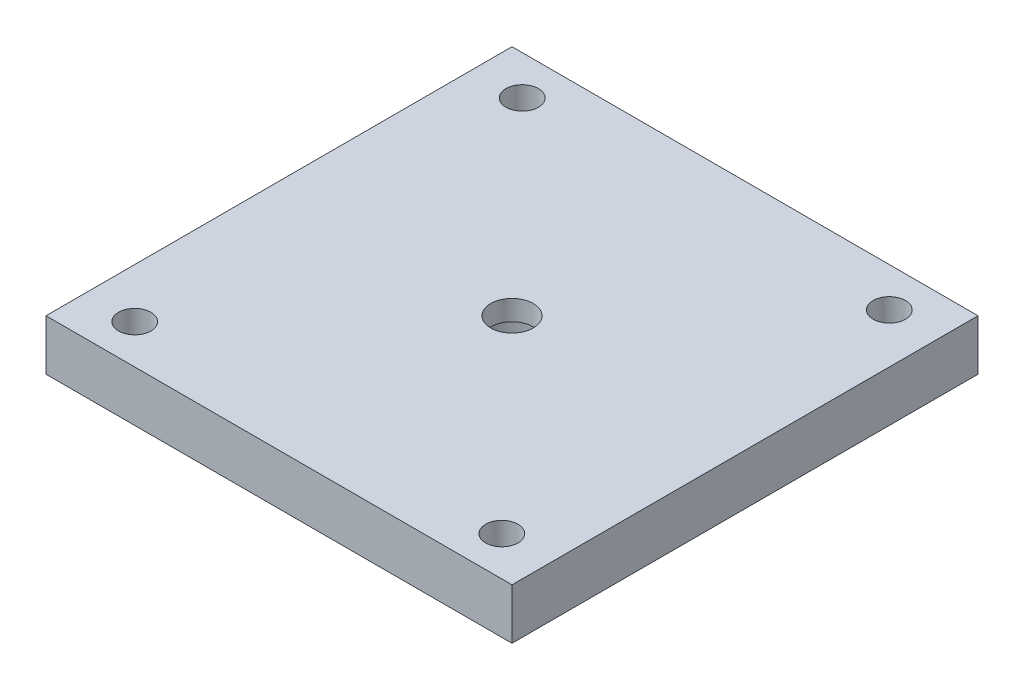
ISO-10303-21;
HEADER;
FILE_DESCRIPTION(('STEP AP214'),'2;1');
FILE_NAME('part.step','',(''),(''),'','','');
FILE_SCHEMA(('AUTOMOTIVE_DESIGN { 1 0 10303 214 1 1 1 1 }'));
ENDSEC;
DATA;
#1=APPLICATION_CONTEXT('core data for automotive mechanical design processes');
#2=APPLICATION_PROTOCOL_DEFINITION('international standard','automotive_design',2000,#1);
#3=PRODUCT_CONTEXT('',#1,'mechanical');
#4=PRODUCT('Part','Part','',(#3));
#5=PRODUCT_RELATED_PRODUCT_CATEGORY('part','',(#4));
#6=PRODUCT_DEFINITION_FORMATION('','',#4);
#7=PRODUCT_DEFINITION_CONTEXT('part definition',#1,'design');
#8=PRODUCT_DEFINITION('design','',#6,#7);
#9=PRODUCT_DEFINITION_SHAPE('','',#8);
#10=(LENGTH_UNIT() NAMED_UNIT(*) SI_UNIT(.MILLI.,.METRE.));
#11=(NAMED_UNIT(*) PLANE_ANGLE_UNIT() SI_UNIT($,.RADIAN.));
#12=(NAMED_UNIT(*) SI_UNIT($,.STERADIAN.) SOLID_ANGLE_UNIT());
#13=UNCERTAINTY_MEASURE_WITH_UNIT(LENGTH_MEASURE(1.E-05),#10,'distance_accuracy_value','');
#14=(GEOMETRIC_REPRESENTATION_CONTEXT(3) GLOBAL_UNCERTAINTY_ASSIGNED_CONTEXT((#13)) GLOBAL_UNIT_ASSIGNED_CONTEXT((#10,
#11,#12)) REPRESENTATION_CONTEXT('',''));
#15=CARTESIAN_POINT('',(0.,0.,0.));
#16=DIRECTION('',(0.,0.,1.));
#17=DIRECTION('',(1.,0.,0.));
#18=AXIS2_PLACEMENT_3D('',#15,#16,#17);
#19=CARTESIAN_POINT('',(23.,5.,-23.));
#20=DIRECTION('',(-1.,0.,0.));
#21=DIRECTION('',(0.,0.,1.));
#22=AXIS2_PLACEMENT_3D('',#19,#20,#21);
#23=PLANE('',#22);
#24=DIRECTION('',(0.,0.,-1.));
#25=VECTOR('',#24,1.);
#26=CARTESIAN_POINT('',(23.,0.,-23.));
#27=LINE('',#26,#25);
#28=CARTESIAN_POINT('',(23.,0.,23.));
#29=VERTEX_POINT('',#28);
#30=CARTESIAN_POINT('',(23.,0.,-23.));
#31=VERTEX_POINT('',#30);
#32=EDGE_CURVE('E202',#29,#31,#27,.T.);
#33=ORIENTED_EDGE('',*,*,#32,.T.);
#34=DIRECTION('',(0.,-1.,0.));
#35=VECTOR('',#34,1.);
#36=CARTESIAN_POINT('',(23.,5.,-23.));
#37=LINE('',#36,#35);
#38=CARTESIAN_POINT('',(23.,5.,-23.));
#39=VERTEX_POINT('',#38);
#40=EDGE_CURVE('E11',#39,#31,#37,.T.);
#41=ORIENTED_EDGE('',*,*,#40,.F.);
#42=DIRECTION('',(0.,0.,-1.));
#43=VECTOR('',#42,1.);
#44=CARTESIAN_POINT('',(23.,5.,-23.));
#45=LINE('',#44,#43);
#46=CARTESIAN_POINT('',(23.,5.,23.));
#47=VERTEX_POINT('',#46);
#48=EDGE_CURVE('E206',#47,#39,#45,.T.);
#49=ORIENTED_EDGE('',*,*,#48,.F.);
#50=DIRECTION('',(0.,-1.,0.));
#51=VECTOR('',#50,1.);
#52=CARTESIAN_POINT('',(23.,5.,23.));
#53=LINE('',#52,#51);
#54=EDGE_CURVE('E216',#47,#29,#53,.T.);
#55=ORIENTED_EDGE('',*,*,#54,.T.);
#56=EDGE_LOOP('',(#33,#41,#49,#55));
#57=FACE_BOUND('',#56,.T.);
#58=ADVANCED_FACE('F33',(#57),#23,.F.);
#59=CARTESIAN_POINT('',(-23.,5.,-23.));
#60=DIRECTION('',(0.,0.,1.));
#61=DIRECTION('',(1.,0.,0.));
#62=AXIS2_PLACEMENT_3D('',#59,#60,#61);
#63=PLANE('',#62);
#64=DIRECTION('',(-1.,0.,0.));
#65=VECTOR('',#64,1.);
#66=CARTESIAN_POINT('',(-23.,0.,-23.));
#67=LINE('',#66,#65);
#68=CARTESIAN_POINT('',(-23.,0.,-23.));
#69=VERTEX_POINT('',#68);
#70=EDGE_CURVE('E219',#31,#69,#67,.T.);
#71=ORIENTED_EDGE('',*,*,#70,.T.);
#72=DIRECTION('',(0.,-1.,0.));
#73=VECTOR('',#72,1.);
#74=CARTESIAN_POINT('',(-23.,5.,-23.));
#75=LINE('',#74,#73);
#76=CARTESIAN_POINT('',(-23.,5.,-23.));
#77=VERTEX_POINT('',#76);
#78=EDGE_CURVE('E41',#77,#69,#75,.T.);
#79=ORIENTED_EDGE('',*,*,#78,.F.);
#80=DIRECTION('',(-1.,0.,0.));
#81=VECTOR('',#80,1.);
#82=CARTESIAN_POINT('',(-23.,5.,-23.));
#83=LINE('',#82,#81);
#84=EDGE_CURVE('E209',#39,#77,#83,.T.);
#85=ORIENTED_EDGE('',*,*,#84,.F.);
#86=ORIENTED_EDGE('',*,*,#40,.T.);
#87=EDGE_LOOP('',(#71,#79,#85,#86));
#88=FACE_BOUND('',#87,.T.);
#89=ADVANCED_FACE('F250',(#88),#63,.F.);
#90=CARTESIAN_POINT('',(-23.,5.,-23.));
#91=DIRECTION('',(1.,0.,0.));
#92=DIRECTION('',(0.,0.,-1.));
#93=AXIS2_PLACEMENT_3D('',#90,#91,#92);
#94=PLANE('',#93);
#95=DIRECTION('',(0.,0.,1.));
#96=VECTOR('',#95,1.);
#97=CARTESIAN_POINT('',(-23.,0.,-23.));
#98=LINE('',#97,#96);
#99=CARTESIAN_POINT('',(-23.,0.,23.));
#100=VERTEX_POINT('',#99);
#101=EDGE_CURVE('E221',#69,#100,#98,.T.);
#102=ORIENTED_EDGE('',*,*,#101,.T.);
#103=DIRECTION('',(0.,-1.,0.));
#104=VECTOR('',#103,1.);
#105=CARTESIAN_POINT('',(-23.,5.,23.));
#106=LINE('',#105,#104);
#107=CARTESIAN_POINT('',(-23.,5.,23.));
#108=VERTEX_POINT('',#107);
#109=EDGE_CURVE('E226',#108,#100,#106,.T.);
#110=ORIENTED_EDGE('',*,*,#109,.F.);
#111=DIRECTION('',(0.,0.,1.));
#112=VECTOR('',#111,1.);
#113=CARTESIAN_POINT('',(-23.,5.,-23.));
#114=LINE('',#113,#112);
#115=EDGE_CURVE('E212',#77,#108,#114,.T.);
#116=ORIENTED_EDGE('',*,*,#115,.F.);
#117=ORIENTED_EDGE('',*,*,#78,.T.);
#118=EDGE_LOOP('',(#102,#110,#116,#117));
#119=FACE_BOUND('',#118,.T.);
#120=ADVANCED_FACE('F234',(#119),#94,.F.);
#121=CARTESIAN_POINT('',(-23.,5.,23.));
#122=DIRECTION('',(0.,0.,-1.));
#123=DIRECTION('',(-1.,0.,0.));
#124=AXIS2_PLACEMENT_3D('',#121,#122,#123);
#125=PLANE('',#124);
#126=DIRECTION('',(1.,0.,0.));
#127=VECTOR('',#126,1.);
#128=CARTESIAN_POINT('',(-23.,0.,23.));
#129=LINE('',#128,#127);
#130=EDGE_CURVE('E210',#100,#29,#129,.T.);
#131=ORIENTED_EDGE('',*,*,#130,.T.);
#132=ORIENTED_EDGE('',*,*,#54,.F.);
#133=DIRECTION('',(1.,0.,0.));
#134=VECTOR('',#133,1.);
#135=CARTESIAN_POINT('',(-23.,5.,23.));
#136=LINE('',#135,#134);
#137=EDGE_CURVE('E214',#108,#47,#136,.T.);
#138=ORIENTED_EDGE('',*,*,#137,.F.);
#139=ORIENTED_EDGE('',*,*,#109,.T.);
#140=EDGE_LOOP('',(#131,#132,#138,#139));
#141=FACE_BOUND('',#140,.T.);
#142=ADVANCED_FACE('F243',(#141),#125,.F.);
#143=CARTESIAN_POINT('',(0.,5.,0.));
#144=DIRECTION('',(0.,1.,0.));
#145=DIRECTION('',(0.,0.,1.));
#146=AXIS2_PLACEMENT_3D('',#143,#144,#145);
#147=PLANE('',#146);
#148=CARTESIAN_POINT('',(-18.12,5.,-19.125));
#149=DIRECTION('',(0.,1.,0.));
#150=DIRECTION('',(0.,0.,1.));
#151=AXIS2_PLACEMENT_3D('',#148,#149,#150);
#152=CIRCLE('',#151,1.6);
#153=CARTESIAN_POINT('',(-18.12,5.,-17.525));
#154=VERTEX_POINT('',#153);
#155=EDGE_CURVE('E362',#154,#154,#152,.T.);
#156=ORIENTED_EDGE('',*,*,#155,.F.);
#157=EDGE_LOOP('',(#156));
#158=FACE_BOUND('',#157,.T.);
#159=CARTESIAN_POINT('',(18.12,5.,-19.125));
#160=DIRECTION('',(0.,1.,0.));
#161=DIRECTION('',(0.,0.,1.));
#162=AXIS2_PLACEMENT_3D('',#159,#160,#161);
#163=CIRCLE('',#162,1.6);
#164=CARTESIAN_POINT('',(18.12,5.,-17.525));
#165=VERTEX_POINT('',#164);
#166=EDGE_CURVE('E352',#165,#165,#163,.T.);
#167=ORIENTED_EDGE('',*,*,#166,.F.);
#168=EDGE_LOOP('',(#167));
#169=FACE_BOUND('',#168,.T.);
#170=CARTESIAN_POINT('',(18.12,5.,19.125));
#171=DIRECTION('',(0.,1.,0.));
#172=DIRECTION('',(0.,0.,1.));
#173=AXIS2_PLACEMENT_3D('',#170,#171,#172);
#174=CIRCLE('',#173,1.6);
#175=CARTESIAN_POINT('',(18.12,5.,20.725));
#176=VERTEX_POINT('',#175);
#177=EDGE_CURVE('E347',#176,#176,#174,.T.);
#178=ORIENTED_EDGE('',*,*,#177,.F.);
#179=EDGE_LOOP('',(#178));
#180=FACE_BOUND('',#179,.T.);
#181=CARTESIAN_POINT('',(-18.12,5.,19.125));
#182=DIRECTION('',(0.,1.,0.));
#183=DIRECTION('',(0.,0.,1.));
#184=AXIS2_PLACEMENT_3D('',#181,#182,#183);
#185=CIRCLE('',#184,1.6);
#186=CARTESIAN_POINT('',(-18.12,5.,20.725));
#187=VERTEX_POINT('',#186);
#188=EDGE_CURVE('E368',#187,#187,#185,.T.);
#189=ORIENTED_EDGE('',*,*,#188,.F.);
#190=EDGE_LOOP('',(#189));
#191=FACE_BOUND('',#190,.T.);
#192=CARTESIAN_POINT('',(0.,5.,0.));
#193=DIRECTION('',(0.,1.,0.));
#194=DIRECTION('',(0.,0.,1.));
#195=AXIS2_PLACEMENT_3D('',#192,#193,#194);
#196=CIRCLE('',#195,2.1);
#197=CARTESIAN_POINT('',(0.,5.,2.1));
#198=VERTEX_POINT('',#197);
#199=EDGE_CURVE('E191',#198,#198,#196,.T.);
#200=ORIENTED_EDGE('',*,*,#199,.F.);
#201=EDGE_LOOP('',(#200));
#202=FACE_BOUND('',#201,.T.);
#203=ORIENTED_EDGE('',*,*,#48,.T.);
#204=ORIENTED_EDGE('',*,*,#84,.T.);
#205=ORIENTED_EDGE('',*,*,#115,.T.);
#206=ORIENTED_EDGE('',*,*,#137,.T.);
#207=EDGE_LOOP('',(#203,#204,#205,#206));
#208=FACE_BOUND('',#207,.T.);
#209=ADVANCED_FACE('F249',(#158,#169,#180,#191,#202,#208),#147,.T.);
#210=CARTESIAN_POINT('',(0.,0.,0.));
#211=DIRECTION('',(0.,1.,0.));
#212=DIRECTION('',(0.,0.,1.));
#213=AXIS2_PLACEMENT_3D('',#210,#211,#212);
#214=PLANE('',#213);
#215=CARTESIAN_POINT('',(-18.12,0.,-19.125));
#216=DIRECTION('',(0.,1.,0.));
#217=DIRECTION('',(0.,0.,1.));
#218=AXIS2_PLACEMENT_3D('',#215,#216,#217);
#219=CIRCLE('',#218,1.6);
#220=CARTESIAN_POINT('',(-18.12,0.,-17.525));
#221=VERTEX_POINT('',#220);
#222=EDGE_CURVE('E365',#221,#221,#219,.T.);
#223=ORIENTED_EDGE('',*,*,#222,.T.);
#224=EDGE_LOOP('',(#223));
#225=FACE_BOUND('',#224,.T.);
#226=CARTESIAN_POINT('',(18.12,0.,-19.125));
#227=DIRECTION('',(0.,1.,0.));
#228=DIRECTION('',(0.,0.,1.));
#229=AXIS2_PLACEMENT_3D('',#226,#227,#228);
#230=CIRCLE('',#229,1.6);
#231=CARTESIAN_POINT('',(18.12,0.,-17.525));
#232=VERTEX_POINT('',#231);
#233=EDGE_CURVE('E357',#232,#232,#230,.T.);
#234=ORIENTED_EDGE('',*,*,#233,.T.);
#235=EDGE_LOOP('',(#234));
#236=FACE_BOUND('',#235,.T.);
#237=CARTESIAN_POINT('',(18.12,0.,19.125));
#238=DIRECTION('',(0.,1.,0.));
#239=DIRECTION('',(0.,0.,1.));
#240=AXIS2_PLACEMENT_3D('',#237,#238,#239);
#241=CIRCLE('',#240,1.6);
#242=CARTESIAN_POINT('',(18.12,0.,20.725));
#243=VERTEX_POINT('',#242);
#244=EDGE_CURVE('E350',#243,#243,#241,.T.);
#245=ORIENTED_EDGE('',*,*,#244,.T.);
#246=EDGE_LOOP('',(#245));
#247=FACE_BOUND('',#246,.T.);
#248=CARTESIAN_POINT('',(-18.12,0.,19.125));
#249=DIRECTION('',(0.,1.,0.));
#250=DIRECTION('',(0.,0.,1.));
#251=AXIS2_PLACEMENT_3D('',#248,#249,#250);
#252=CIRCLE('',#251,1.6);
#253=CARTESIAN_POINT('',(-18.12,0.,20.725));
#254=VERTEX_POINT('',#253);
#255=EDGE_CURVE('E354',#254,#254,#252,.T.);
#256=ORIENTED_EDGE('',*,*,#255,.T.);
#257=EDGE_LOOP('',(#256));
#258=FACE_BOUND('',#257,.T.);
#259=DIRECTION('',(1.,0.,0.));
#260=VECTOR('',#259,1.);
#261=CARTESIAN_POINT('',(-10.,0.,2.5));
#262=LINE('',#261,#260);
#263=CARTESIAN_POINT('',(-10.,0.,2.5));
#264=VERTEX_POINT('',#263);
#265=CARTESIAN_POINT('',(-5.,0.,2.5));
#266=VERTEX_POINT('',#265);
#267=EDGE_CURVE('E147',#264,#266,#262,.T.);
#268=ORIENTED_EDGE('',*,*,#267,.T.);
#269=DIRECTION('',(0.,0.,-1.));
#270=VECTOR('',#269,1.);
#271=CARTESIAN_POINT('',(-5.,0.,2.5));
#272=LINE('',#271,#270);
#273=CARTESIAN_POINT('',(-5.,0.,-2.5));
#274=VERTEX_POINT('',#273);
#275=EDGE_CURVE('E157',#266,#274,#272,.T.);
#276=ORIENTED_EDGE('',*,*,#275,.T.);
#277=DIRECTION('',(-1.,0.,0.));
#278=VECTOR('',#277,1.);
#279=CARTESIAN_POINT('',(-10.,0.,-2.5));
#280=LINE('',#279,#278);
#281=CARTESIAN_POINT('',(-10.,0.,-2.5));
#282=VERTEX_POINT('',#281);
#283=EDGE_CURVE('E127',#274,#282,#280,.T.);
#284=ORIENTED_EDGE('',*,*,#283,.T.);
#285=DIRECTION('',(0.,0.,1.));
#286=VECTOR('',#285,1.);
#287=CARTESIAN_POINT('',(-10.,0.,2.5));
#288=LINE('',#287,#286);
#289=EDGE_CURVE('E48',#282,#264,#288,.T.);
#290=ORIENTED_EDGE('',*,*,#289,.T.);
#291=EDGE_LOOP('',(#268,#276,#284,#290));
#292=FACE_BOUND('',#291,.T.);
#293=DIRECTION('',(1.,0.,0.));
#294=VECTOR('',#293,1.);
#295=CARTESIAN_POINT('',(5.,0.,2.5));
#296=LINE('',#295,#294);
#297=CARTESIAN_POINT('',(5.,0.,2.5));
#298=VERTEX_POINT('',#297);
#299=CARTESIAN_POINT('',(10.,0.,2.5));
#300=VERTEX_POINT('',#299);
#301=EDGE_CURVE('E171',#298,#300,#296,.T.);
#302=ORIENTED_EDGE('',*,*,#301,.T.);
#303=DIRECTION('',(0.,0.,-1.));
#304=VECTOR('',#303,1.);
#305=CARTESIAN_POINT('',(10.,0.,-2.5));
#306=LINE('',#305,#304);
#307=CARTESIAN_POINT('',(10.,0.,-2.5));
#308=VERTEX_POINT('',#307);
#309=EDGE_CURVE('E163',#300,#308,#306,.T.);
#310=ORIENTED_EDGE('',*,*,#309,.T.);
#311=DIRECTION('',(-1.,0.,0.));
#312=VECTOR('',#311,1.);
#313=CARTESIAN_POINT('',(5.,0.,-2.5));
#314=LINE('',#313,#312);
#315=CARTESIAN_POINT('',(5.,0.,-2.5));
#316=VERTEX_POINT('',#315);
#317=EDGE_CURVE('E183',#308,#316,#314,.T.);
#318=ORIENTED_EDGE('',*,*,#317,.T.);
#319=DIRECTION('',(0.,0.,1.));
#320=VECTOR('',#319,1.);
#321=CARTESIAN_POINT('',(5.,0.,-2.5));
#322=LINE('',#321,#320);
#323=EDGE_CURVE('E56',#316,#298,#322,.T.);
#324=ORIENTED_EDGE('',*,*,#323,.T.);
#325=EDGE_LOOP('',(#302,#310,#318,#324));
#326=FACE_BOUND('',#325,.T.);
#327=CARTESIAN_POINT('',(0.,0.,0.));
#328=DIRECTION('',(0.,1.,0.));
#329=DIRECTION('',(0.,0.,1.));
#330=AXIS2_PLACEMENT_3D('',#327,#328,#329);
#331=CIRCLE('',#330,4.1);
#332=CARTESIAN_POINT('',(0.,0.,4.1));
#333=VERTEX_POINT('',#332);
#334=EDGE_CURVE('E203',#333,#333,#331,.T.);
#335=ORIENTED_EDGE('',*,*,#334,.T.);
#336=EDGE_LOOP('',(#335));
#337=FACE_BOUND('',#336,.T.);
#338=ORIENTED_EDGE('',*,*,#32,.F.);
#339=ORIENTED_EDGE('',*,*,#130,.F.);
#340=ORIENTED_EDGE('',*,*,#101,.F.);
#341=ORIENTED_EDGE('',*,*,#70,.F.);
#342=EDGE_LOOP('',(#338,#339,#340,#341));
#343=FACE_BOUND('',#342,.T.);
#344=ADVANCED_FACE('F240',(#225,#236,#247,#258,#292,#326,#337,#343),#214,.F.);
#345=CARTESIAN_POINT('',(0.,3.,0.));
#346=DIRECTION('',(0.,-1.,0.));
#347=DIRECTION('',(0.,0.,-1.));
#348=AXIS2_PLACEMENT_3D('',#345,#346,#347);
#349=CYLINDRICAL_SURFACE('',#348,4.1);
#350=CARTESIAN_POINT('',(0.,3.,0.));
#351=DIRECTION('',(0.,1.,0.));
#352=DIRECTION('',(0.,0.,1.));
#353=AXIS2_PLACEMENT_3D('',#350,#351,#352);
#354=CIRCLE('',#353,4.1);
#355=CARTESIAN_POINT('',(0.,3.,4.1));
#356=VERTEX_POINT('',#355);
#357=EDGE_CURVE('E199',#356,#356,#354,.T.);
#358=ORIENTED_EDGE('',*,*,#357,.T.);
#359=EDGE_LOOP('',(#358));
#360=FACE_BOUND('',#359,.T.);
#361=ORIENTED_EDGE('',*,*,#334,.F.);
#362=EDGE_LOOP('',(#361));
#363=FACE_BOUND('',#362,.T.);
#364=ADVANCED_FACE('F262',(#360,#363),#349,.F.);
#365=CARTESIAN_POINT('',(0.,3.,0.));
#366=DIRECTION('',(0.,1.,0.));
#367=DIRECTION('',(0.,0.,1.));
#368=AXIS2_PLACEMENT_3D('',#365,#366,#367);
#369=PLANE('',#368);
#370=CARTESIAN_POINT('',(0.,3.,0.));
#371=DIRECTION('',(0.,1.,0.));
#372=DIRECTION('',(0.,0.,1.));
#373=AXIS2_PLACEMENT_3D('',#370,#371,#372);
#374=CIRCLE('',#373,2.1);
#375=CARTESIAN_POINT('',(0.,3.,2.1));
#376=VERTEX_POINT('',#375);
#377=EDGE_CURVE('E36',#376,#376,#374,.F.);
#378=ORIENTED_EDGE('',*,*,#377,.F.);
#379=EDGE_LOOP('',(#378));
#380=FACE_BOUND('',#379,.T.);
#381=ORIENTED_EDGE('',*,*,#357,.F.);
#382=EDGE_LOOP('',(#381));
#383=FACE_BOUND('',#382,.T.);
#384=ADVANCED_FACE('F269',(#380,#383),#369,.F.);
#385=CARTESIAN_POINT('',(0.,5.,0.));
#386=DIRECTION('',(0.,-1.,0.));
#387=DIRECTION('',(0.,0.,-1.));
#388=AXIS2_PLACEMENT_3D('',#385,#386,#387);
#389=CYLINDRICAL_SURFACE('',#388,2.1);
#390=ORIENTED_EDGE('',*,*,#199,.T.);
#391=EDGE_LOOP('',(#390));
#392=FACE_BOUND('',#391,.T.);
#393=ORIENTED_EDGE('',*,*,#377,.T.);
#394=EDGE_LOOP('',(#393));
#395=FACE_BOUND('',#394,.T.);
#396=ADVANCED_FACE('F273',(#392,#395),#389,.F.);
#397=CARTESIAN_POINT('',(10.,-2.,-2.5));
#398=DIRECTION('',(1.,0.,0.));
#399=DIRECTION('',(0.,0.,-1.));
#400=AXIS2_PLACEMENT_3D('',#397,#398,#399);
#401=PLANE('',#400);
#402=ORIENTED_EDGE('',*,*,#309,.F.);
#403=DIRECTION('',(0.,1.,0.));
#404=VECTOR('',#403,1.);
#405=CARTESIAN_POINT('',(10.,-2.,2.5));
#406=LINE('',#405,#404);
#407=CARTESIAN_POINT('',(10.,-2.,2.5));
#408=VERTEX_POINT('',#407);
#409=EDGE_CURVE('E189',#408,#300,#406,.T.);
#410=ORIENTED_EDGE('',*,*,#409,.F.);
#411=DIRECTION('',(0.,0.,-1.));
#412=VECTOR('',#411,1.);
#413=CARTESIAN_POINT('',(10.,-2.,-2.5));
#414=LINE('',#413,#412);
#415=CARTESIAN_POINT('',(10.,-2.,-2.5));
#416=VERTEX_POINT('',#415);
#417=EDGE_CURVE('E167',#408,#416,#414,.T.);
#418=ORIENTED_EDGE('',*,*,#417,.T.);
#419=DIRECTION('',(0.,1.,0.));
#420=VECTOR('',#419,1.);
#421=CARTESIAN_POINT('',(10.,-2.,-2.5));
#422=LINE('',#421,#420);
#423=EDGE_CURVE('E180',#416,#308,#422,.T.);
#424=ORIENTED_EDGE('',*,*,#423,.T.);
#425=EDGE_LOOP('',(#402,#410,#418,#424));
#426=FACE_BOUND('',#425,.T.);
#427=ADVANCED_FACE('F277',(#426),#401,.T.);
#428=CARTESIAN_POINT('',(5.,-2.,2.5));
#429=DIRECTION('',(0.,0.,1.));
#430=DIRECTION('',(1.,0.,0.));
#431=AXIS2_PLACEMENT_3D('',#428,#429,#430);
#432=PLANE('',#431);
#433=ORIENTED_EDGE('',*,*,#301,.F.);
#434=DIRECTION('',(0.,1.,0.));
#435=VECTOR('',#434,1.);
#436=CARTESIAN_POINT('',(5.,-2.,2.5));
#437=LINE('',#436,#435);
#438=CARTESIAN_POINT('',(5.,-2.,2.5));
#439=VERTEX_POINT('',#438);
#440=EDGE_CURVE('E192',#439,#298,#437,.T.);
#441=ORIENTED_EDGE('',*,*,#440,.F.);
#442=DIRECTION('',(1.,0.,0.));
#443=VECTOR('',#442,1.);
#444=CARTESIAN_POINT('',(5.,-2.,2.5));
#445=LINE('',#444,#443);
#446=EDGE_CURVE('E177',#439,#408,#445,.T.);
#447=ORIENTED_EDGE('',*,*,#446,.T.);
#448=ORIENTED_EDGE('',*,*,#409,.T.);
#449=EDGE_LOOP('',(#433,#441,#447,#448));
#450=FACE_BOUND('',#449,.T.);
#451=ADVANCED_FACE('F281',(#450),#432,.T.);
#452=CARTESIAN_POINT('',(5.,-2.,-2.5));
#453=DIRECTION('',(-1.,0.,0.));
#454=DIRECTION('',(0.,0.,1.));
#455=AXIS2_PLACEMENT_3D('',#452,#453,#454);
#456=PLANE('',#455);
#457=ORIENTED_EDGE('',*,*,#323,.F.);
#458=DIRECTION('',(0.,1.,0.));
#459=VECTOR('',#458,1.);
#460=CARTESIAN_POINT('',(5.,-2.,-2.5));
#461=LINE('',#460,#459);
#462=CARTESIAN_POINT('',(5.,-2.,-2.5));
#463=VERTEX_POINT('',#462);
#464=EDGE_CURVE('E194',#463,#316,#461,.T.);
#465=ORIENTED_EDGE('',*,*,#464,.F.);
#466=DIRECTION('',(0.,0.,1.));
#467=VECTOR('',#466,1.);
#468=CARTESIAN_POINT('',(5.,-2.,-2.5));
#469=LINE('',#468,#467);
#470=EDGE_CURVE('E174',#463,#439,#469,.T.);
#471=ORIENTED_EDGE('',*,*,#470,.T.);
#472=ORIENTED_EDGE('',*,*,#440,.T.);
#473=EDGE_LOOP('',(#457,#465,#471,#472));
#474=FACE_BOUND('',#473,.T.);
#475=ADVANCED_FACE('F287',(#474),#456,.T.);
#476=CARTESIAN_POINT('',(5.,-2.,-2.5));
#477=DIRECTION('',(0.,0.,-1.));
#478=DIRECTION('',(-1.,0.,0.));
#479=AXIS2_PLACEMENT_3D('',#476,#477,#478);
#480=PLANE('',#479);
#481=ORIENTED_EDGE('',*,*,#317,.F.);
#482=ORIENTED_EDGE('',*,*,#423,.F.);
#483=DIRECTION('',(-1.,0.,0.));
#484=VECTOR('',#483,1.);
#485=CARTESIAN_POINT('',(5.,-2.,-2.5));
#486=LINE('',#485,#484);
#487=EDGE_CURVE('E170',#416,#463,#486,.T.);
#488=ORIENTED_EDGE('',*,*,#487,.T.);
#489=ORIENTED_EDGE('',*,*,#464,.T.);
#490=EDGE_LOOP('',(#481,#482,#488,#489));
#491=FACE_BOUND('',#490,.T.);
#492=ADVANCED_FACE('F283',(#491),#480,.T.);
#493=CARTESIAN_POINT('',(0.,-2.,0.));
#494=DIRECTION('',(0.,1.,0.));
#495=DIRECTION('',(0.,0.,1.));
#496=AXIS2_PLACEMENT_3D('',#493,#494,#495);
#497=PLANE('',#496);
#498=CARTESIAN_POINT('',(7.5,-2.,0.));
#499=DIRECTION('',(0.,-1.,0.));
#500=DIRECTION('',(0.,0.,-1.));
#501=AXIS2_PLACEMENT_3D('',#498,#499,#500);
#502=CIRCLE('',#501,0.999999999999999);
#503=CARTESIAN_POINT('',(7.5,-2.,-0.999999999999998));
#504=VERTEX_POINT('',#503);
#505=EDGE_CURVE('E152',#504,#504,#502,.T.);
#506=ORIENTED_EDGE('',*,*,#505,.F.);
#507=EDGE_LOOP('',(#506));
#508=FACE_BOUND('',#507,.T.);
#509=ORIENTED_EDGE('',*,*,#417,.F.);
#510=ORIENTED_EDGE('',*,*,#446,.F.);
#511=ORIENTED_EDGE('',*,*,#470,.F.);
#512=ORIENTED_EDGE('',*,*,#487,.F.);
#513=EDGE_LOOP('',(#509,#510,#511,#512));
#514=FACE_BOUND('',#513,.T.);
#515=ADVANCED_FACE('F286',(#508,#514),#497,.F.);
#516=CARTESIAN_POINT('',(-5.,-2.,2.5));
#517=DIRECTION('',(1.,0.,0.));
#518=DIRECTION('',(0.,0.,-1.));
#519=AXIS2_PLACEMENT_3D('',#516,#517,#518);
#520=PLANE('',#519);
#521=ORIENTED_EDGE('',*,*,#275,.F.);
#522=DIRECTION('',(0.,1.,0.));
#523=VECTOR('',#522,1.);
#524=CARTESIAN_POINT('',(-5.,-2.,2.5));
#525=LINE('',#524,#523);
#526=CARTESIAN_POINT('',(-5.,-2.,2.5));
#527=VERTEX_POINT('',#526);
#528=EDGE_CURVE('E146',#527,#266,#525,.T.);
#529=ORIENTED_EDGE('',*,*,#528,.F.);
#530=DIRECTION('',(0.,0.,-1.));
#531=VECTOR('',#530,1.);
#532=CARTESIAN_POINT('',(-5.,-2.,2.5));
#533=LINE('',#532,#531);
#534=CARTESIAN_POINT('',(-5.,-2.,-2.5));
#535=VERTEX_POINT('',#534);
#536=EDGE_CURVE('E140',#527,#535,#533,.T.);
#537=ORIENTED_EDGE('',*,*,#536,.T.);
#538=DIRECTION('',(0.,1.,0.));
#539=VECTOR('',#538,1.);
#540=CARTESIAN_POINT('',(-5.,-2.,-2.5));
#541=LINE('',#540,#539);
#542=EDGE_CURVE('E122',#535,#274,#541,.T.);
#543=ORIENTED_EDGE('',*,*,#542,.T.);
#544=EDGE_LOOP('',(#521,#529,#537,#543));
#545=FACE_BOUND('',#544,.T.);
#546=ADVANCED_FACE('F145',(#545),#520,.T.);
#547=CARTESIAN_POINT('',(-10.,-2.,2.5));
#548=DIRECTION('',(0.,0.,1.));
#549=DIRECTION('',(1.,0.,0.));
#550=AXIS2_PLACEMENT_3D('',#547,#548,#549);
#551=PLANE('',#550);
#552=ORIENTED_EDGE('',*,*,#267,.F.);
#553=DIRECTION('',(0.,1.,0.));
#554=VECTOR('',#553,1.);
#555=CARTESIAN_POINT('',(-10.,-2.,2.5));
#556=LINE('',#555,#554);
#557=CARTESIAN_POINT('',(-10.,-2.,2.5));
#558=VERTEX_POINT('',#557);
#559=EDGE_CURVE('E164',#558,#264,#556,.T.);
#560=ORIENTED_EDGE('',*,*,#559,.F.);
#561=DIRECTION('',(1.,0.,0.));
#562=VECTOR('',#561,1.);
#563=CARTESIAN_POINT('',(-10.,-2.,2.5));
#564=LINE('',#563,#562);
#565=EDGE_CURVE('E133',#558,#527,#564,.T.);
#566=ORIENTED_EDGE('',*,*,#565,.T.);
#567=ORIENTED_EDGE('',*,*,#528,.T.);
#568=EDGE_LOOP('',(#552,#560,#566,#567));
#569=FACE_BOUND('',#568,.T.);
#570=ADVANCED_FACE('F299',(#569),#551,.T.);
#571=CARTESIAN_POINT('',(-10.,-2.,2.5));
#572=DIRECTION('',(-1.,0.,0.));
#573=DIRECTION('',(0.,0.,1.));
#574=AXIS2_PLACEMENT_3D('',#571,#572,#573);
#575=PLANE('',#574);
#576=ORIENTED_EDGE('',*,*,#289,.F.);
#577=DIRECTION('',(0.,1.,0.));
#578=VECTOR('',#577,1.);
#579=CARTESIAN_POINT('',(-10.,-2.,-2.5));
#580=LINE('',#579,#578);
#581=CARTESIAN_POINT('',(-10.,-2.,-2.5));
#582=VERTEX_POINT('',#581);
#583=EDGE_CURVE('E132',#582,#282,#580,.T.);
#584=ORIENTED_EDGE('',*,*,#583,.F.);
#585=DIRECTION('',(0.,0.,1.));
#586=VECTOR('',#585,1.);
#587=CARTESIAN_POINT('',(-10.,-2.,2.5));
#588=LINE('',#587,#586);
#589=EDGE_CURVE('E143',#582,#558,#588,.T.);
#590=ORIENTED_EDGE('',*,*,#589,.T.);
#591=ORIENTED_EDGE('',*,*,#559,.T.);
#592=EDGE_LOOP('',(#576,#584,#590,#591));
#593=FACE_BOUND('',#592,.T.);
#594=ADVANCED_FACE('F302',(#593),#575,.T.);
#595=CARTESIAN_POINT('',(-10.,-2.,-2.5));
#596=DIRECTION('',(0.,0.,-1.));
#597=DIRECTION('',(-1.,0.,0.));
#598=AXIS2_PLACEMENT_3D('',#595,#596,#597);
#599=PLANE('',#598);
#600=ORIENTED_EDGE('',*,*,#283,.F.);
#601=ORIENTED_EDGE('',*,*,#542,.F.);
#602=DIRECTION('',(-1.,0.,0.));
#603=VECTOR('',#602,1.);
#604=CARTESIAN_POINT('',(-10.,-2.,-2.5));
#605=LINE('',#604,#603);
#606=EDGE_CURVE('E125',#535,#582,#605,.T.);
#607=ORIENTED_EDGE('',*,*,#606,.T.);
#608=ORIENTED_EDGE('',*,*,#583,.T.);
#609=EDGE_LOOP('',(#600,#601,#607,#608));
#610=FACE_BOUND('',#609,.T.);
#611=ADVANCED_FACE('F124',(#610),#599,.T.);
#612=CARTESIAN_POINT('',(0.,-2.,0.));
#613=DIRECTION('',(0.,-1.,0.));
#614=DIRECTION('',(0.,0.,-1.));
#615=AXIS2_PLACEMENT_3D('',#612,#613,#614);
#616=PLANE('',#615);
#617=CARTESIAN_POINT('',(-7.5,-2.,0.));
#618=DIRECTION('',(0.,-1.,0.));
#619=DIRECTION('',(0.,0.,-1.));
#620=AXIS2_PLACEMENT_3D('',#617,#618,#619);
#621=CIRCLE('',#620,1.);
#622=CARTESIAN_POINT('',(-7.5,-2.,-1.));
#623=VERTEX_POINT('',#622);
#624=EDGE_CURVE('E375',#623,#623,#621,.T.);
#625=ORIENTED_EDGE('',*,*,#624,.F.);
#626=EDGE_LOOP('',(#625));
#627=FACE_BOUND('',#626,.T.);
#628=ORIENTED_EDGE('',*,*,#536,.F.);
#629=ORIENTED_EDGE('',*,*,#565,.F.);
#630=ORIENTED_EDGE('',*,*,#589,.F.);
#631=ORIENTED_EDGE('',*,*,#606,.F.);
#632=EDGE_LOOP('',(#628,#629,#630,#631));
#633=FACE_BOUND('',#632,.T.);
#634=ADVANCED_FACE('F138',(#627,#633),#616,.T.);
#635=CARTESIAN_POINT('',(-7.5,3.,0.));
#636=DIRECTION('',(0.,-1.,0.));
#637=DIRECTION('',(0.,0.,-1.));
#638=AXIS2_PLACEMENT_3D('',#635,#636,#637);
#639=CYLINDRICAL_SURFACE('',#638,1.);
#640=CARTESIAN_POINT('',(-7.5,3.,0.));
#641=DIRECTION('',(0.,-1.,0.));
#642=DIRECTION('',(0.,0.,-1.));
#643=AXIS2_PLACEMENT_3D('',#640,#641,#642);
#644=CIRCLE('',#643,1.);
#645=CARTESIAN_POINT('',(-7.5,3.,-1.));
#646=VERTEX_POINT('',#645);
#647=EDGE_CURVE('E159',#646,#646,#644,.T.);
#648=ORIENTED_EDGE('',*,*,#647,.F.);
#649=EDGE_LOOP('',(#648));
#650=FACE_BOUND('',#649,.T.);
#651=ORIENTED_EDGE('',*,*,#624,.T.);
#652=EDGE_LOOP('',(#651));
#653=FACE_BOUND('',#652,.T.);
#654=ADVANCED_FACE('F310',(#650,#653),#639,.F.);
#655=CARTESIAN_POINT('',(-7.5,3.,0.));
#656=DIRECTION('',(0.,-1.,0.));
#657=DIRECTION('',(0.,0.,-1.));
#658=AXIS2_PLACEMENT_3D('',#655,#656,#657);
#659=PLANE('',#658);
#660=ORIENTED_EDGE('',*,*,#647,.T.);
#661=EDGE_LOOP('',(#660));
#662=FACE_BOUND('',#661,.T.);
#663=ADVANCED_FACE('F316',(#662),#659,.T.);
#664=CARTESIAN_POINT('',(7.5,3.,0.));
#665=DIRECTION('',(0.,-1.,0.));
#666=DIRECTION('',(0.,0.,-1.));
#667=AXIS2_PLACEMENT_3D('',#664,#665,#666);
#668=CYLINDRICAL_SURFACE('',#667,0.999999999999999);
#669=CARTESIAN_POINT('',(7.5,3.,0.));
#670=DIRECTION('',(0.,-1.,0.));
#671=DIRECTION('',(0.,0.,-1.));
#672=AXIS2_PLACEMENT_3D('',#669,#670,#671);
#673=CIRCLE('',#672,0.999999999999999);
#674=CARTESIAN_POINT('',(7.5,3.,-0.999999999999998));
#675=VERTEX_POINT('',#674);
#676=EDGE_CURVE('E377',#675,#675,#673,.T.);
#677=ORIENTED_EDGE('',*,*,#676,.F.);
#678=EDGE_LOOP('',(#677));
#679=FACE_BOUND('',#678,.T.);
#680=ORIENTED_EDGE('',*,*,#505,.T.);
#681=EDGE_LOOP('',(#680));
#682=FACE_BOUND('',#681,.T.);
#683=ADVANCED_FACE('F312',(#679,#682),#668,.F.);
#684=CARTESIAN_POINT('',(7.5,3.,0.));
#685=DIRECTION('',(0.,-1.,0.));
#686=DIRECTION('',(0.,0.,-1.));
#687=AXIS2_PLACEMENT_3D('',#684,#685,#686);
#688=PLANE('',#687);
#689=ORIENTED_EDGE('',*,*,#676,.T.);
#690=EDGE_LOOP('',(#689));
#691=FACE_BOUND('',#690,.T.);
#692=ADVANCED_FACE('F315',(#691),#688,.T.);
#693=CARTESIAN_POINT('',(-18.12,5.,19.125));
#694=DIRECTION('',(0.,-1.,0.));
#695=DIRECTION('',(0.,0.,-1.));
#696=AXIS2_PLACEMENT_3D('',#693,#694,#695);
#697=CYLINDRICAL_SURFACE('',#696,1.6);
#698=ORIENTED_EDGE('',*,*,#188,.T.);
#699=EDGE_LOOP('',(#698));
#700=FACE_BOUND('',#699,.T.);
#701=ORIENTED_EDGE('',*,*,#255,.F.);
#702=EDGE_LOOP('',(#701));
#703=FACE_BOUND('',#702,.T.);
#704=ADVANCED_FACE('F320',(#700,#703),#697,.F.);
#705=CARTESIAN_POINT('',(18.12,5.,19.125));
#706=DIRECTION('',(0.,-1.,0.));
#707=DIRECTION('',(0.,0.,-1.));
#708=AXIS2_PLACEMENT_3D('',#705,#706,#707);
#709=CYLINDRICAL_SURFACE('',#708,1.6);
#710=ORIENTED_EDGE('',*,*,#177,.T.);
#711=EDGE_LOOP('',(#710));
#712=FACE_BOUND('',#711,.T.);
#713=ORIENTED_EDGE('',*,*,#244,.F.);
#714=EDGE_LOOP('',(#713));
#715=FACE_BOUND('',#714,.T.);
#716=ADVANCED_FACE('F330',(#712,#715),#709,.F.);
#717=CARTESIAN_POINT('',(18.12,5.,-19.125));
#718=DIRECTION('',(0.,-1.,0.));
#719=DIRECTION('',(0.,0.,-1.));
#720=AXIS2_PLACEMENT_3D('',#717,#718,#719);
#721=CYLINDRICAL_SURFACE('',#720,1.6);
#722=ORIENTED_EDGE('',*,*,#166,.T.);
#723=EDGE_LOOP('',(#722));
#724=FACE_BOUND('',#723,.T.);
#725=ORIENTED_EDGE('',*,*,#233,.F.);
#726=EDGE_LOOP('',(#725));
#727=FACE_BOUND('',#726,.T.);
#728=ADVANCED_FACE('F335',(#724,#727),#721,.F.);
#729=CARTESIAN_POINT('',(-18.12,5.,-19.125));
#730=DIRECTION('',(0.,-1.,0.));
#731=DIRECTION('',(0.,0.,-1.));
#732=AXIS2_PLACEMENT_3D('',#729,#730,#731);
#733=CYLINDRICAL_SURFACE('',#732,1.6);
#734=ORIENTED_EDGE('',*,*,#155,.T.);
#735=EDGE_LOOP('',(#734));
#736=FACE_BOUND('',#735,.T.);
#737=ORIENTED_EDGE('',*,*,#222,.F.);
#738=EDGE_LOOP('',(#737));
#739=FACE_BOUND('',#738,.T.);
#740=ADVANCED_FACE('F332',(#736,#739),#733,.F.);
#741=CLOSED_SHELL('',(#58,#89,#120,#142,#209,#344,#364,#384,#396,#427,#451,#475,#492,#515,#546,
#570,#594,#611,#634,#654,#663,#683,#692,#704,#716,#728,#740));
#742=MANIFOLD_SOLID_BREP('B2',#741);
#743=ADVANCED_BREP_SHAPE_REPRESENTATION('',(#18,#742),#14);
#744=SHAPE_DEFINITION_REPRESENTATION(#9,#743);
ENDSEC;
END-ISO-10303-21;
